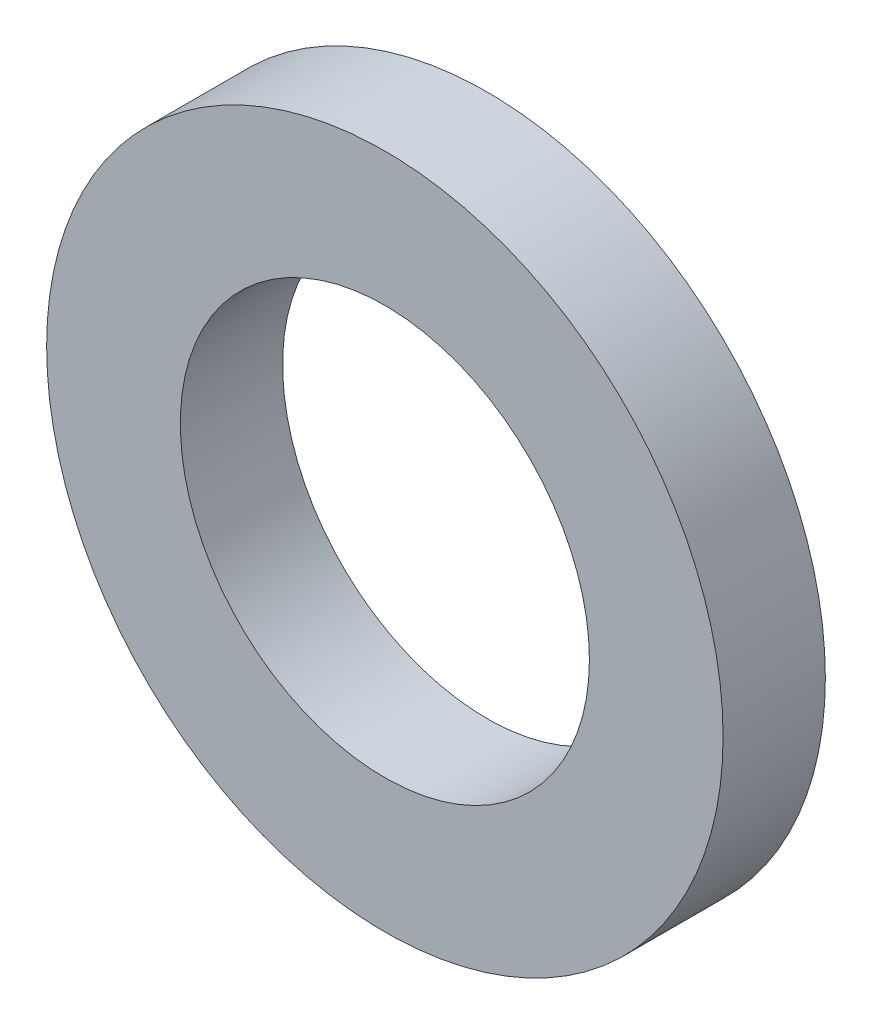
ISO-10303-21;
HEADER;
FILE_DESCRIPTION(('STEP AP214'),'2;1');
FILE_NAME('part.step','',(''),(''),'','','');
FILE_SCHEMA(('AUTOMOTIVE_DESIGN { 1 0 10303 214 1 1 1 1 }'));
ENDSEC;
DATA;
#1=APPLICATION_CONTEXT('core data for automotive mechanical design processes');
#2=APPLICATION_PROTOCOL_DEFINITION('international standard','automotive_design',2000,#1);
#3=PRODUCT_CONTEXT('',#1,'mechanical');
#4=PRODUCT('Part','Part','',(#3));
#5=PRODUCT_RELATED_PRODUCT_CATEGORY('part','',(#4));
#6=PRODUCT_DEFINITION_FORMATION('','',#4);
#7=PRODUCT_DEFINITION_CONTEXT('part definition',#1,'design');
#8=PRODUCT_DEFINITION('design','',#6,#7);
#9=PRODUCT_DEFINITION_SHAPE('','',#8);
#10=(LENGTH_UNIT() NAMED_UNIT(*) SI_UNIT(.MILLI.,.METRE.));
#11=(NAMED_UNIT(*) PLANE_ANGLE_UNIT() SI_UNIT($,.RADIAN.));
#12=(NAMED_UNIT(*) SI_UNIT($,.STERADIAN.) SOLID_ANGLE_UNIT());
#13=UNCERTAINTY_MEASURE_WITH_UNIT(LENGTH_MEASURE(1.E-05),#10,'distance_accuracy_value','');
#14=(GEOMETRIC_REPRESENTATION_CONTEXT(3) GLOBAL_UNCERTAINTY_ASSIGNED_CONTEXT((#13)) GLOBAL_UNIT_ASSIGNED_CONTEXT((#10,
#11,#12)) REPRESENTATION_CONTEXT('',''));
#15=CARTESIAN_POINT('',(0.,0.,0.));
#16=DIRECTION('',(0.,0.,1.));
#17=DIRECTION('',(1.,0.,0.));
#18=AXIS2_PLACEMENT_3D('',#15,#16,#17);
#19=CARTESIAN_POINT('',(0.,0.,3.175));
#20=DIRECTION('',(0.,0.,1.));
#21=DIRECTION('',(1.,0.,0.));
#22=AXIS2_PLACEMENT_3D('',#19,#20,#21);
#23=PLANE('',#22);
#24=CARTESIAN_POINT('',(0.,0.,3.175));
#25=DIRECTION('',(0.,0.,1.));
#26=DIRECTION('',(1.,0.,0.));
#27=AXIS2_PLACEMENT_3D('',#24,#25,#26);
#28=CIRCLE('',#27,10.5);
#29=CARTESIAN_POINT('',(10.5,0.,3.175));
#30=VERTEX_POINT('',#29);
#31=EDGE_CURVE('E11',#30,#30,#28,.T.);
#32=ORIENTED_EDGE('',*,*,#31,.T.);
#33=EDGE_LOOP('',(#32));
#34=FACE_BOUND('',#33,.T.);
#35=CARTESIAN_POINT('',(0.,0.,3.175));
#36=DIRECTION('',(0.,0.,1.));
#37=DIRECTION('',(1.,0.,0.));
#38=AXIS2_PLACEMENT_3D('',#35,#36,#37);
#39=CIRCLE('',#38,6.35);
#40=CARTESIAN_POINT('',(6.35,0.,3.175));
#41=VERTEX_POINT('',#40);
#42=EDGE_CURVE('E54',#41,#41,#39,.T.);
#43=ORIENTED_EDGE('',*,*,#42,.F.);
#44=EDGE_LOOP('',(#43));
#45=FACE_BOUND('',#44,.T.);
#46=ADVANCED_FACE('F43',(#34,#45),#23,.T.);
#47=CARTESIAN_POINT('',(0.,0.,0.));
#48=DIRECTION('',(0.,0.,1.));
#49=DIRECTION('',(1.,0.,0.));
#50=AXIS2_PLACEMENT_3D('',#47,#48,#49);
#51=PLANE('',#50);
#52=CARTESIAN_POINT('',(0.,0.,0.));
#53=DIRECTION('',(0.,0.,1.));
#54=DIRECTION('',(1.,0.,0.));
#55=AXIS2_PLACEMENT_3D('',#52,#53,#54);
#56=CIRCLE('',#55,10.5);
#57=CARTESIAN_POINT('',(10.5,0.,0.));
#58=VERTEX_POINT('',#57);
#59=EDGE_CURVE('E47',#58,#58,#56,.T.);
#60=ORIENTED_EDGE('',*,*,#59,.F.);
#61=EDGE_LOOP('',(#60));
#62=FACE_BOUND('',#61,.T.);
#63=CARTESIAN_POINT('',(0.,0.,0.));
#64=DIRECTION('',(0.,0.,1.));
#65=DIRECTION('',(1.,0.,0.));
#66=AXIS2_PLACEMENT_3D('',#63,#64,#65);
#67=CIRCLE('',#66,6.35);
#68=CARTESIAN_POINT('',(6.35,0.,0.));
#69=VERTEX_POINT('',#68);
#70=EDGE_CURVE('E56',#69,#69,#67,.T.);
#71=ORIENTED_EDGE('',*,*,#70,.T.);
#72=EDGE_LOOP('',(#71));
#73=FACE_BOUND('',#72,.T.);
#74=ADVANCED_FACE('F66',(#62,#73),#51,.F.);
#75=CARTESIAN_POINT('',(0.,0.,3.175));
#76=DIRECTION('',(0.,0.,-1.));
#77=DIRECTION('',(-1.,0.,0.));
#78=AXIS2_PLACEMENT_3D('',#75,#76,#77);
#79=CYLINDRICAL_SURFACE('',#78,10.5);
#80=ORIENTED_EDGE('',*,*,#31,.F.);
#81=EDGE_LOOP('',(#80));
#82=FACE_BOUND('',#81,.T.);
#83=ORIENTED_EDGE('',*,*,#59,.T.);
#84=EDGE_LOOP('',(#83));
#85=FACE_BOUND('',#84,.T.);
#86=ADVANCED_FACE('F45',(#82,#85),#79,.T.);
#87=CARTESIAN_POINT('',(0.,0.,3.175));
#88=DIRECTION('',(0.,0.,-1.));
#89=DIRECTION('',(-1.,0.,0.));
#90=AXIS2_PLACEMENT_3D('',#87,#88,#89);
#91=CYLINDRICAL_SURFACE('',#90,6.35);
#92=ORIENTED_EDGE('',*,*,#42,.T.);
#93=EDGE_LOOP('',(#92));
#94=FACE_BOUND('',#93,.T.);
#95=ORIENTED_EDGE('',*,*,#70,.F.);
#96=EDGE_LOOP('',(#95));
#97=FACE_BOUND('',#96,.T.);
#98=ADVANCED_FACE('F62',(#94,#97),#91,.F.);
#99=CLOSED_SHELL('',(#46,#74,#86,#98));
#100=MANIFOLD_SOLID_BREP('B2',#99);
#101=ADVANCED_BREP_SHAPE_REPRESENTATION('',(#18,#100),#14);
#102=SHAPE_DEFINITION_REPRESENTATION(#9,#101);
ENDSEC;
END-ISO-10303-21;
